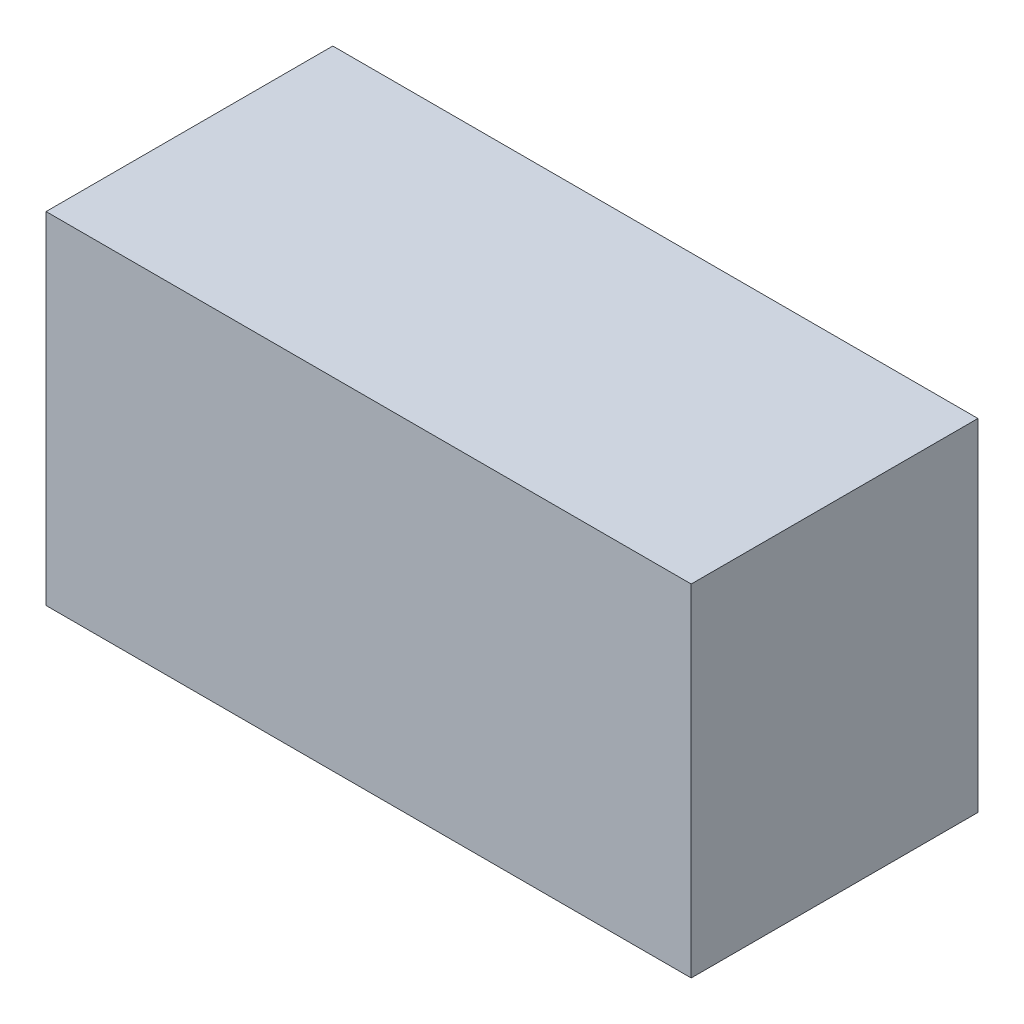
ISO-10303-21;
HEADER;
FILE_DESCRIPTION(('STEP AP214'),'2;1');
FILE_NAME('part.step','',(''),(''),'','','');
FILE_SCHEMA(('AUTOMOTIVE_DESIGN { 1 0 10303 214 1 1 1 1 }'));
ENDSEC;
DATA;
#1=APPLICATION_CONTEXT('core data for automotive mechanical design processes');
#2=APPLICATION_PROTOCOL_DEFINITION('international standard','automotive_design',2000,#1);
#3=PRODUCT_CONTEXT('',#1,'mechanical');
#4=PRODUCT('Part','Part','',(#3));
#5=PRODUCT_RELATED_PRODUCT_CATEGORY('part','',(#4));
#6=PRODUCT_DEFINITION_FORMATION('','',#4);
#7=PRODUCT_DEFINITION_CONTEXT('part definition',#1,'design');
#8=PRODUCT_DEFINITION('design','',#6,#7);
#9=PRODUCT_DEFINITION_SHAPE('','',#8);
#10=(LENGTH_UNIT() NAMED_UNIT(*) SI_UNIT(.MILLI.,.METRE.));
#11=(NAMED_UNIT(*) PLANE_ANGLE_UNIT() SI_UNIT($,.RADIAN.));
#12=(NAMED_UNIT(*) SI_UNIT($,.STERADIAN.) SOLID_ANGLE_UNIT());
#13=UNCERTAINTY_MEASURE_WITH_UNIT(LENGTH_MEASURE(1.E-05),#10,'distance_accuracy_value','');
#14=(GEOMETRIC_REPRESENTATION_CONTEXT(3) GLOBAL_UNCERTAINTY_ASSIGNED_CONTEXT((#13)) GLOBAL_UNIT_ASSIGNED_CONTEXT((#10,
#11,#12)) REPRESENTATION_CONTEXT('',''));
#15=CARTESIAN_POINT('',(0.,0.,0.));
#16=DIRECTION('',(0.,0.,1.));
#17=DIRECTION('',(1.,0.,0.));
#18=AXIS2_PLACEMENT_3D('',#15,#16,#17);
#19=CARTESIAN_POINT('',(11.25,5.95,5.));
#20=DIRECTION('',(-1.,0.,0.));
#21=DIRECTION('',(0.,0.,1.));
#22=AXIS2_PLACEMENT_3D('',#19,#20,#21);
#23=PLANE('',#22);
#24=DIRECTION('',(0.,1.,0.));
#25=VECTOR('',#24,1.);
#26=CARTESIAN_POINT('',(11.25,5.95,-5.));
#27=LINE('',#26,#25);
#28=CARTESIAN_POINT('',(11.25,-5.95,-5.));
#29=VERTEX_POINT('',#28);
#30=CARTESIAN_POINT('',(11.25,5.95,-5.));
#31=VERTEX_POINT('',#30);
#32=EDGE_CURVE('E99',#29,#31,#27,.T.);
#33=ORIENTED_EDGE('',*,*,#32,.T.);
#34=DIRECTION('',(0.,0.,-1.));
#35=VECTOR('',#34,1.);
#36=CARTESIAN_POINT('',(11.25,5.95,5.));
#37=LINE('',#36,#35);
#38=CARTESIAN_POINT('',(11.25,5.95,5.));
#39=VERTEX_POINT('',#38);
#40=EDGE_CURVE('E41',#39,#31,#37,.T.);
#41=ORIENTED_EDGE('',*,*,#40,.F.);
#42=DIRECTION('',(0.,1.,0.));
#43=VECTOR('',#42,1.);
#44=CARTESIAN_POINT('',(11.25,5.95,5.));
#45=LINE('',#44,#43);
#46=CARTESIAN_POINT('',(11.25,-5.95,5.));
#47=VERTEX_POINT('',#46);
#48=EDGE_CURVE('E85',#47,#39,#45,.T.);
#49=ORIENTED_EDGE('',*,*,#48,.F.);
#50=DIRECTION('',(0.,0.,-1.));
#51=VECTOR('',#50,1.);
#52=CARTESIAN_POINT('',(11.25,-5.95,5.));
#53=LINE('',#52,#51);
#54=EDGE_CURVE('E95',#47,#29,#53,.T.);
#55=ORIENTED_EDGE('',*,*,#54,.T.);
#56=EDGE_LOOP('',(#33,#41,#49,#55));
#57=FACE_BOUND('',#56,.T.);
#58=ADVANCED_FACE('F33',(#57),#23,.F.);
#59=CARTESIAN_POINT('',(-11.25,5.95,5.));
#60=DIRECTION('',(0.,-1.,0.));
#61=DIRECTION('',(0.,0.,-1.));
#62=AXIS2_PLACEMENT_3D('',#59,#60,#61);
#63=PLANE('',#62);
#64=DIRECTION('',(-1.,0.,0.));
#65=VECTOR('',#64,1.);
#66=CARTESIAN_POINT('',(-11.25,5.95,-5.));
#67=LINE('',#66,#65);
#68=CARTESIAN_POINT('',(-11.25,5.95,-5.));
#69=VERTEX_POINT('',#68);
#70=EDGE_CURVE('E90',#31,#69,#67,.T.);
#71=ORIENTED_EDGE('',*,*,#70,.T.);
#72=DIRECTION('',(0.,0.,-1.));
#73=VECTOR('',#72,1.);
#74=CARTESIAN_POINT('',(-11.25,5.95,5.));
#75=LINE('',#74,#73);
#76=CARTESIAN_POINT('',(-11.25,5.95,5.));
#77=VERTEX_POINT('',#76);
#78=EDGE_CURVE('E88',#77,#69,#75,.T.);
#79=ORIENTED_EDGE('',*,*,#78,.F.);
#80=DIRECTION('',(-1.,0.,0.));
#81=VECTOR('',#80,1.);
#82=CARTESIAN_POINT('',(-11.25,5.95,5.));
#83=LINE('',#82,#81);
#84=EDGE_CURVE('E80',#39,#77,#83,.T.);
#85=ORIENTED_EDGE('',*,*,#84,.F.);
#86=ORIENTED_EDGE('',*,*,#40,.T.);
#87=EDGE_LOOP('',(#71,#79,#85,#86));
#88=FACE_BOUND('',#87,.T.);
#89=ADVANCED_FACE('F89',(#88),#63,.F.);
#90=CARTESIAN_POINT('',(-11.25,5.95,5.));
#91=DIRECTION('',(1.,0.,0.));
#92=DIRECTION('',(0.,1.,0.));
#93=AXIS2_PLACEMENT_3D('',#90,#91,#92);
#94=PLANE('',#93);
#95=DIRECTION('',(0.,-1.,0.));
#96=VECTOR('',#95,1.);
#97=CARTESIAN_POINT('',(-11.25,5.95,-5.));
#98=LINE('',#97,#96);
#99=CARTESIAN_POINT('',(-11.25,-5.95,-5.));
#100=VERTEX_POINT('',#99);
#101=EDGE_CURVE('E66',#69,#100,#98,.T.);
#102=ORIENTED_EDGE('',*,*,#101,.T.);
#103=DIRECTION('',(0.,0.,-1.));
#104=VECTOR('',#103,1.);
#105=CARTESIAN_POINT('',(-11.25,-5.95,5.));
#106=LINE('',#105,#104);
#107=CARTESIAN_POINT('',(-11.25,-5.95,5.));
#108=VERTEX_POINT('',#107);
#109=EDGE_CURVE('E91',#108,#100,#106,.T.);
#110=ORIENTED_EDGE('',*,*,#109,.F.);
#111=DIRECTION('',(0.,-1.,0.));
#112=VECTOR('',#111,1.);
#113=CARTESIAN_POINT('',(-11.25,5.95,5.));
#114=LINE('',#113,#112);
#115=EDGE_CURVE('E83',#77,#108,#114,.T.);
#116=ORIENTED_EDGE('',*,*,#115,.F.);
#117=ORIENTED_EDGE('',*,*,#78,.T.);
#118=EDGE_LOOP('',(#102,#110,#116,#117));
#119=FACE_BOUND('',#118,.T.);
#120=ADVANCED_FACE('F93',(#119),#94,.F.);
#121=CARTESIAN_POINT('',(-11.25,-5.95,5.));
#122=DIRECTION('',(0.,1.,0.));
#123=DIRECTION('',(0.,0.,1.));
#124=AXIS2_PLACEMENT_3D('',#121,#122,#123);
#125=PLANE('',#124);
#126=DIRECTION('',(1.,0.,0.));
#127=VECTOR('',#126,1.);
#128=CARTESIAN_POINT('',(-11.25,-5.95,-5.));
#129=LINE('',#128,#127);
#130=EDGE_CURVE('E72',#100,#29,#129,.T.);
#131=ORIENTED_EDGE('',*,*,#130,.T.);
#132=ORIENTED_EDGE('',*,*,#54,.F.);
#133=DIRECTION('',(1.,0.,0.));
#134=VECTOR('',#133,1.);
#135=CARTESIAN_POINT('',(-11.25,-5.95,5.));
#136=LINE('',#135,#134);
#137=EDGE_CURVE('E49',#108,#47,#136,.T.);
#138=ORIENTED_EDGE('',*,*,#137,.F.);
#139=ORIENTED_EDGE('',*,*,#109,.T.);
#140=EDGE_LOOP('',(#131,#132,#138,#139));
#141=FACE_BOUND('',#140,.T.);
#142=ADVANCED_FACE('F122',(#141),#125,.F.);
#143=CARTESIAN_POINT('',(0.,0.,5.));
#144=DIRECTION('',(0.,0.,1.));
#145=DIRECTION('',(1.,0.,0.));
#146=AXIS2_PLACEMENT_3D('',#143,#144,#145);
#147=PLANE('',#146);
#148=ORIENTED_EDGE('',*,*,#48,.T.);
#149=ORIENTED_EDGE('',*,*,#84,.T.);
#150=ORIENTED_EDGE('',*,*,#115,.T.);
#151=ORIENTED_EDGE('',*,*,#137,.T.);
#152=EDGE_LOOP('',(#148,#149,#150,#151));
#153=FACE_BOUND('',#152,.T.);
#154=ADVANCED_FACE('F81',(#153),#147,.T.);
#155=CARTESIAN_POINT('',(0.,0.,-5.));
#156=DIRECTION('',(0.,0.,1.));
#157=DIRECTION('',(1.,0.,0.));
#158=AXIS2_PLACEMENT_3D('',#155,#156,#157);
#159=PLANE('',#158);
#160=CARTESIAN_POINT('',(0.,0.,-5.));
#161=DIRECTION('',(0.,0.,1.));
#162=DIRECTION('',(1.,0.,0.));
#163=AXIS2_PLACEMENT_3D('',#160,#161,#162);
#164=CIRCLE('',#163,1.5);
#165=CARTESIAN_POINT('',(1.5,0.,-5.));
#166=VERTEX_POINT('',#165);
#167=EDGE_CURVE('E11',#166,#166,#164,.F.);
#168=ORIENTED_EDGE('',*,*,#167,.F.);
#169=EDGE_LOOP('',(#168));
#170=FACE_BOUND('',#169,.T.);
#171=ORIENTED_EDGE('',*,*,#32,.F.);
#172=ORIENTED_EDGE('',*,*,#130,.F.);
#173=ORIENTED_EDGE('',*,*,#101,.F.);
#174=ORIENTED_EDGE('',*,*,#70,.F.);
#175=EDGE_LOOP('',(#171,#172,#173,#174));
#176=FACE_BOUND('',#175,.T.);
#177=ADVANCED_FACE('F110',(#170,#176),#159,.F.);
#178=CARTESIAN_POINT('',(0.,0.,-9.));
#179=DIRECTION('',(0.,0.,1.));
#180=DIRECTION('',(1.,0.,0.));
#181=AXIS2_PLACEMENT_3D('',#178,#179,#180);
#182=CYLINDRICAL_SURFACE('',#181,1.5);
#183=CARTESIAN_POINT('',(0.,0.,-9.));
#184=DIRECTION('',(0.,0.,-1.));
#185=DIRECTION('',(-1.,0.,0.));
#186=AXIS2_PLACEMENT_3D('',#183,#184,#185);
#187=CIRCLE('',#186,1.5);
#188=CARTESIAN_POINT('',(-1.5,0.,-9.));
#189=VERTEX_POINT('',#188);
#190=EDGE_CURVE('E102',#189,#189,#187,.T.);
#191=ORIENTED_EDGE('',*,*,#190,.F.);
#192=EDGE_LOOP('',(#191));
#193=FACE_BOUND('',#192,.T.);
#194=ORIENTED_EDGE('',*,*,#167,.T.);
#195=EDGE_LOOP('',(#194));
#196=FACE_BOUND('',#195,.T.);
#197=ADVANCED_FACE('F112',(#193,#196),#182,.T.);
#198=CARTESIAN_POINT('',(0.,0.,-9.));
#199=DIRECTION('',(0.,0.,-1.));
#200=DIRECTION('',(-1.,0.,0.));
#201=AXIS2_PLACEMENT_3D('',#198,#199,#200);
#202=PLANE('',#201);
#203=ORIENTED_EDGE('',*,*,#190,.T.);
#204=EDGE_LOOP('',(#203));
#205=FACE_BOUND('',#204,.T.);
#206=ADVANCED_FACE('F119',(#205),#202,.T.);
#207=CLOSED_SHELL('',(#58,#89,#120,#142,#154,#177,#197,#206));
#208=MANIFOLD_SOLID_BREP('B2',#207);
#209=ADVANCED_BREP_SHAPE_REPRESENTATION('',(#18,#208),#14);
#210=SHAPE_DEFINITION_REPRESENTATION(#9,#209);
ENDSEC;
END-ISO-10303-21;
